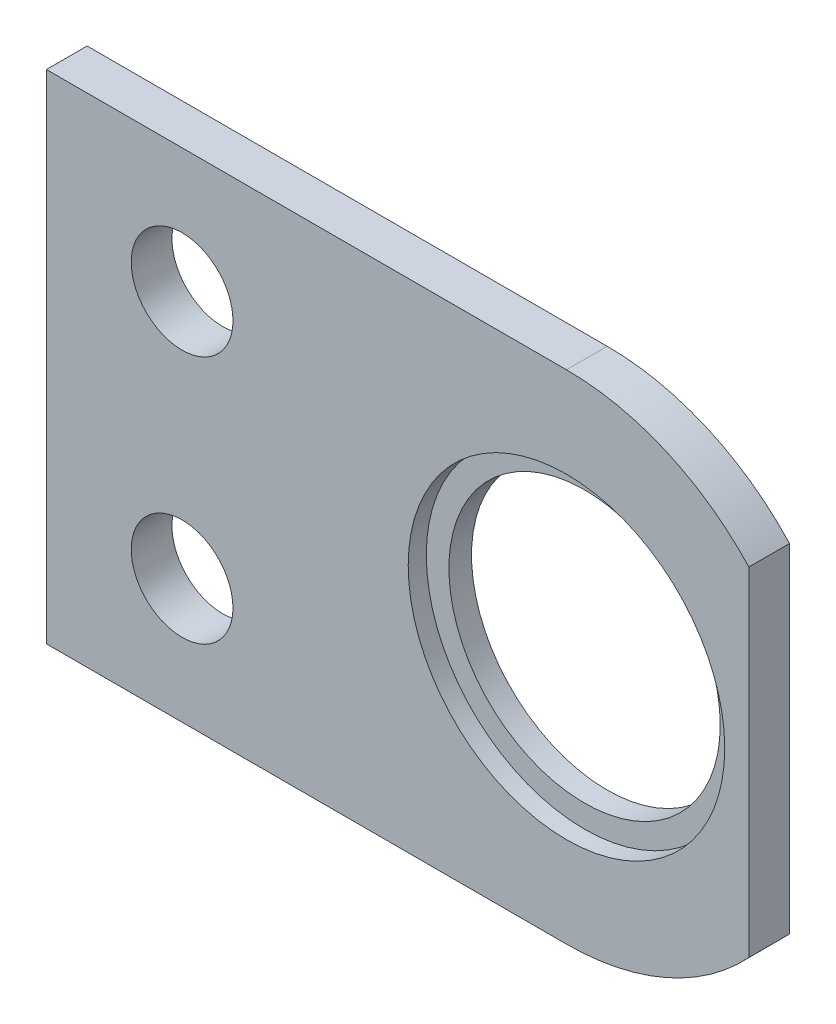
ISO-10303-21;
HEADER;
FILE_DESCRIPTION(('STEP AP214'),'2;1');
FILE_NAME('part.step','',(''),(''),'','','');
FILE_SCHEMA(('AUTOMOTIVE_DESIGN { 1 0 10303 214 1 1 1 1 }'));
ENDSEC;
DATA;
#1=APPLICATION_CONTEXT('core data for automotive mechanical design processes');
#2=APPLICATION_PROTOCOL_DEFINITION('international standard','automotive_design',2000,#1);
#3=PRODUCT_CONTEXT('',#1,'mechanical');
#4=PRODUCT('Part','Part','',(#3));
#5=PRODUCT_RELATED_PRODUCT_CATEGORY('part','',(#4));
#6=PRODUCT_DEFINITION_FORMATION('','',#4);
#7=PRODUCT_DEFINITION_CONTEXT('part definition',#1,'design');
#8=PRODUCT_DEFINITION('design','',#6,#7);
#9=PRODUCT_DEFINITION_SHAPE('','',#8);
#10=(LENGTH_UNIT() NAMED_UNIT(*) SI_UNIT(.MILLI.,.METRE.));
#11=(NAMED_UNIT(*) PLANE_ANGLE_UNIT() SI_UNIT($,.RADIAN.));
#12=(NAMED_UNIT(*) SI_UNIT($,.STERADIAN.) SOLID_ANGLE_UNIT());
#13=UNCERTAINTY_MEASURE_WITH_UNIT(LENGTH_MEASURE(1.E-05),#10,'distance_accuracy_value','');
#14=(GEOMETRIC_REPRESENTATION_CONTEXT(3) GLOBAL_UNCERTAINTY_ASSIGNED_CONTEXT((#13)) GLOBAL_UNIT_ASSIGNED_CONTEXT((#10,
#11,#12)) REPRESENTATION_CONTEXT('',''));
#15=CARTESIAN_POINT('',(0.,0.,0.));
#16=DIRECTION('',(0.,0.,1.));
#17=DIRECTION('',(1.,0.,0.));
#18=AXIS2_PLACEMENT_3D('',#15,#16,#17);
#19=CARTESIAN_POINT('',(-8.06644929286193,0.,1.8));
#20=DIRECTION('',(0.,0.,-1.));
#21=DIRECTION('',(-1.,0.,0.));
#22=AXIS2_PLACEMENT_3D('',#19,#20,#21);
#23=CYLINDRICAL_SURFACE('',#22,5.99999999999845);
#24=CARTESIAN_POINT('',(-8.06644929286193,0.,0.));
#25=DIRECTION('',(0.,0.,1.));
#26=DIRECTION('',(1.,0.,0.));
#27=AXIS2_PLACEMENT_3D('',#24,#25,#26);
#28=CIRCLE('',#27,5.99999999999845);
#29=CARTESIAN_POINT('',(-2.06644929286348,0.,0.));
#30=VERTEX_POINT('',#29);
#31=EDGE_CURVE('E255',#30,#30,#28,.T.);
#32=ORIENTED_EDGE('',*,*,#31,.F.);
#33=EDGE_LOOP('',(#32));
#34=FACE_BOUND('',#33,.T.);
#35=CARTESIAN_POINT('',(-8.06644929286193,0.,1.));
#36=DIRECTION('',(0.,0.,1.));
#37=DIRECTION('',(1.,0.,0.));
#38=AXIS2_PLACEMENT_3D('',#35,#36,#37);
#39=CIRCLE('',#38,5.99999999999845);
#40=CARTESIAN_POINT('',(-2.06644929286348,0.,1.));
#41=VERTEX_POINT('',#40);
#42=EDGE_CURVE('E39',#41,#41,#39,.T.);
#43=ORIENTED_EDGE('',*,*,#42,.T.);
#44=EDGE_LOOP('',(#43));
#45=FACE_BOUND('',#44,.T.);
#46=ADVANCED_FACE('F35',(#34,#45),#23,.F.);
#47=CARTESIAN_POINT('',(-8.06644929286193,0.,1.8));
#48=DIRECTION('',(0.,0.,1.));
#49=DIRECTION('',(1.,0.,0.));
#50=AXIS2_PLACEMENT_3D('',#47,#48,#49);
#51=PLANE('',#50);
#52=CARTESIAN_POINT('',(-8.06644929286193,0.,1.8));
#53=DIRECTION('',(0.,0.,1.));
#54=DIRECTION('',(1.,0.,0.));
#55=AXIS2_PLACEMENT_3D('',#52,#53,#54);
#56=CIRCLE('',#55,7.);
#57=CARTESIAN_POINT('',(-1.06644929286193,0.,1.8));
#58=VERTEX_POINT('',#57);
#59=EDGE_CURVE('E253',#58,#58,#56,.T.);
#60=ORIENTED_EDGE('',*,*,#59,.F.);
#61=EDGE_LOOP('',(#60));
#62=FACE_BOUND('',#61,.T.);
#63=CARTESIAN_POINT('',(-25.0664492928641,-5.50000000000008,1.8));
#64=DIRECTION('',(0.,0.,1.));
#65=DIRECTION('',(1.,0.,0.));
#66=AXIS2_PLACEMENT_3D('',#63,#64,#65);
#67=CIRCLE('',#66,2.25000000000009);
#68=CARTESIAN_POINT('',(-22.816449292864,-5.50000000000008,1.8));
#69=VERTEX_POINT('',#68);
#70=EDGE_CURVE('E262',#69,#69,#67,.T.);
#71=ORIENTED_EDGE('',*,*,#70,.F.);
#72=EDGE_LOOP('',(#71));
#73=FACE_BOUND('',#72,.T.);
#74=CARTESIAN_POINT('',(-8.06644929286193,0.,1.8));
#75=DIRECTION('',(0.,0.,1.));
#76=DIRECTION('',(1.,0.,0.));
#77=AXIS2_PLACEMENT_3D('',#74,#75,#76);
#78=CIRCLE('',#77,10.9999999999981);
#79=CARTESIAN_POINT('',(0.,7.47879641423996,1.8));
#80=VERTEX_POINT('',#79);
#81=CARTESIAN_POINT('',(-8.06644929286193,10.9999999999979,1.8));
#82=VERTEX_POINT('',#81);
#83=EDGE_CURVE('E133',#80,#82,#78,.T.);
#84=ORIENTED_EDGE('',*,*,#83,.T.);
#85=DIRECTION('',(-1.,0.,0.));
#86=VECTOR('',#85,1.);
#87=CARTESIAN_POINT('',(-8.06644929286193,10.9999999999979,1.8));
#88=LINE('',#87,#86);
#89=CARTESIAN_POINT('',(-31.0664492928643,10.9999999999979,1.8));
#90=VERTEX_POINT('',#89);
#91=EDGE_CURVE('E90',#82,#90,#88,.T.);
#92=ORIENTED_EDGE('',*,*,#91,.T.);
#93=DIRECTION('',(0.,-1.,0.));
#94=VECTOR('',#93,1.);
#95=CARTESIAN_POINT('',(-31.0664492928643,-10.9999999999984,1.8));
#96=LINE('',#95,#94);
#97=CARTESIAN_POINT('',(-31.0664492928643,-10.9999999999984,1.8));
#98=VERTEX_POINT('',#97);
#99=EDGE_CURVE('E104',#90,#98,#96,.T.);
#100=ORIENTED_EDGE('',*,*,#99,.T.);
#101=DIRECTION('',(1.,0.,0.));
#102=VECTOR('',#101,1.);
#103=CARTESIAN_POINT('',(-31.0664492928643,-10.9999999999984,1.8));
#104=LINE('',#103,#102);
#105=CARTESIAN_POINT('',(-8.06644929286193,-10.9999999999982,1.8));
#106=VERTEX_POINT('',#105);
#107=EDGE_CURVE('E97',#98,#106,#104,.T.);
#108=ORIENTED_EDGE('',*,*,#107,.T.);
#109=CARTESIAN_POINT('',(-8.06644929286193,0.,1.8));
#110=DIRECTION('',(0.,0.,1.));
#111=DIRECTION('',(1.,0.,0.));
#112=AXIS2_PLACEMENT_3D('',#109,#110,#111);
#113=CIRCLE('',#112,10.9999999999982);
#114=CARTESIAN_POINT('',(0.,-7.47879641423979,1.8));
#115=VERTEX_POINT('',#114);
#116=EDGE_CURVE('E102',#106,#115,#113,.T.);
#117=ORIENTED_EDGE('',*,*,#116,.T.);
#118=DIRECTION('',(0.,1.,0.));
#119=VECTOR('',#118,1.);
#120=CARTESIAN_POINT('',(0.,7.47879641423996,1.8));
#121=LINE('',#120,#119);
#122=EDGE_CURVE('E53',#115,#80,#121,.T.);
#123=ORIENTED_EDGE('',*,*,#122,.T.);
#124=EDGE_LOOP('',(#84,#92,#100,#108,#117,#123));
#125=FACE_BOUND('',#124,.T.);
#126=CARTESIAN_POINT('',(-25.0664492928641,5.49999999999982,1.8));
#127=DIRECTION('',(0.,0.,1.));
#128=DIRECTION('',(1.,0.,0.));
#129=AXIS2_PLACEMENT_3D('',#126,#127,#128);
#130=CIRCLE('',#129,2.25000000000009);
#131=CARTESIAN_POINT('',(-22.816449292864,5.49999999999982,1.8));
#132=VERTEX_POINT('',#131);
#133=EDGE_CURVE('E126',#132,#132,#130,.T.);
#134=ORIENTED_EDGE('',*,*,#133,.F.);
#135=EDGE_LOOP('',(#134));
#136=FACE_BOUND('',#135,.T.);
#137=ADVANCED_FACE('F99',(#62,#73,#125,#136),#51,.T.);
#138=CARTESIAN_POINT('',(-8.06644929286193,0.,0.));
#139=DIRECTION('',(0.,0.,1.));
#140=DIRECTION('',(1.,0.,0.));
#141=AXIS2_PLACEMENT_3D('',#138,#139,#140);
#142=PLANE('',#141);
#143=CARTESIAN_POINT('',(-8.06644929286193,0.,0.));
#144=DIRECTION('',(0.,0.,1.));
#145=DIRECTION('',(1.,0.,0.));
#146=AXIS2_PLACEMENT_3D('',#143,#144,#145);
#147=CIRCLE('',#146,10.9999999999981);
#148=CARTESIAN_POINT('',(0.,7.47879641423996,0.));
#149=VERTEX_POINT('',#148);
#150=CARTESIAN_POINT('',(-8.06644929286193,10.9999999999979,0.));
#151=VERTEX_POINT('',#150);
#152=EDGE_CURVE('E122',#149,#151,#147,.T.);
#153=ORIENTED_EDGE('',*,*,#152,.F.);
#154=DIRECTION('',(0.,1.,0.));
#155=VECTOR('',#154,1.);
#156=CARTESIAN_POINT('',(0.,7.47879641423996,0.));
#157=LINE('',#156,#155);
#158=CARTESIAN_POINT('',(0.,-7.47879641423979,0.));
#159=VERTEX_POINT('',#158);
#160=EDGE_CURVE('E82',#159,#149,#157,.T.);
#161=ORIENTED_EDGE('',*,*,#160,.F.);
#162=CARTESIAN_POINT('',(-8.06644929286193,0.,0.));
#163=DIRECTION('',(0.,0.,1.));
#164=DIRECTION('',(1.,0.,0.));
#165=AXIS2_PLACEMENT_3D('',#162,#163,#164);
#166=CIRCLE('',#165,10.9999999999982);
#167=CARTESIAN_POINT('',(-8.06644929286193,-10.9999999999982,0.));
#168=VERTEX_POINT('',#167);
#169=EDGE_CURVE('E76',#168,#159,#166,.T.);
#170=ORIENTED_EDGE('',*,*,#169,.F.);
#171=DIRECTION('',(1.,0.,0.));
#172=VECTOR('',#171,1.);
#173=CARTESIAN_POINT('',(-31.0664492928643,-10.9999999999984,0.));
#174=LINE('',#173,#172);
#175=CARTESIAN_POINT('',(-31.0664492928643,-10.9999999999984,0.));
#176=VERTEX_POINT('',#175);
#177=EDGE_CURVE('E112',#176,#168,#174,.T.);
#178=ORIENTED_EDGE('',*,*,#177,.F.);
#179=DIRECTION('',(0.,-1.,0.));
#180=VECTOR('',#179,1.);
#181=CARTESIAN_POINT('',(-31.0664492928643,-10.9999999999984,0.));
#182=LINE('',#181,#180);
#183=CARTESIAN_POINT('',(-31.0664492928643,10.9999999999979,0.));
#184=VERTEX_POINT('',#183);
#185=EDGE_CURVE('E128',#184,#176,#182,.T.);
#186=ORIENTED_EDGE('',*,*,#185,.F.);
#187=DIRECTION('',(-1.,0.,0.));
#188=VECTOR('',#187,1.);
#189=CARTESIAN_POINT('',(-8.06644929286193,10.9999999999979,0.));
#190=LINE('',#189,#188);
#191=EDGE_CURVE('E125',#151,#184,#190,.T.);
#192=ORIENTED_EDGE('',*,*,#191,.F.);
#193=EDGE_LOOP('',(#153,#161,#170,#178,#186,#192));
#194=FACE_BOUND('',#193,.T.);
#195=CARTESIAN_POINT('',(-25.0664492928641,5.49999999999982,0.));
#196=DIRECTION('',(0.,0.,1.));
#197=DIRECTION('',(1.,0.,0.));
#198=AXIS2_PLACEMENT_3D('',#195,#196,#197);
#199=CIRCLE('',#198,2.25000000000009);
#200=CARTESIAN_POINT('',(-22.816449292864,5.49999999999982,0.));
#201=VERTEX_POINT('',#200);
#202=EDGE_CURVE('E265',#201,#201,#199,.T.);
#203=ORIENTED_EDGE('',*,*,#202,.T.);
#204=EDGE_LOOP('',(#203));
#205=FACE_BOUND('',#204,.T.);
#206=CARTESIAN_POINT('',(-25.0664492928641,-5.50000000000008,0.));
#207=DIRECTION('',(0.,0.,1.));
#208=DIRECTION('',(1.,0.,0.));
#209=AXIS2_PLACEMENT_3D('',#206,#207,#208);
#210=CIRCLE('',#209,2.25000000000009);
#211=CARTESIAN_POINT('',(-22.816449292864,-5.50000000000008,0.));
#212=VERTEX_POINT('',#211);
#213=EDGE_CURVE('E261',#212,#212,#210,.T.);
#214=ORIENTED_EDGE('',*,*,#213,.T.);
#215=EDGE_LOOP('',(#214));
#216=FACE_BOUND('',#215,.T.);
#217=ORIENTED_EDGE('',*,*,#31,.T.);
#218=EDGE_LOOP('',(#217));
#219=FACE_BOUND('',#218,.T.);
#220=ADVANCED_FACE('F143',(#194,#205,#216,#219),#142,.F.);
#221=CARTESIAN_POINT('',(-8.06644929286193,0.,1.8));
#222=DIRECTION('',(0.,0.,-1.));
#223=DIRECTION('',(-1.,0.,0.));
#224=AXIS2_PLACEMENT_3D('',#221,#222,#223);
#225=CYLINDRICAL_SURFACE('',#224,10.9999999999981);
#226=ORIENTED_EDGE('',*,*,#152,.T.);
#227=DIRECTION('',(0.,0.,-1.));
#228=VECTOR('',#227,1.);
#229=CARTESIAN_POINT('',(-8.06644929286193,10.9999999999979,1.8));
#230=LINE('',#229,#228);
#231=EDGE_CURVE('E11',#82,#151,#230,.T.);
#232=ORIENTED_EDGE('',*,*,#231,.F.);
#233=ORIENTED_EDGE('',*,*,#83,.F.);
#234=DIRECTION('',(0.,0.,-1.));
#235=VECTOR('',#234,1.);
#236=CARTESIAN_POINT('',(0.,7.47879641423996,1.8));
#237=LINE('',#236,#235);
#238=EDGE_CURVE('E118',#80,#149,#237,.T.);
#239=ORIENTED_EDGE('',*,*,#238,.T.);
#240=EDGE_LOOP('',(#226,#232,#233,#239));
#241=FACE_BOUND('',#240,.T.);
#242=ADVANCED_FACE('F37',(#241),#225,.T.);
#243=CARTESIAN_POINT('',(-8.06644929286193,10.9999999999979,1.8));
#244=DIRECTION('',(0.,-1.,0.));
#245=DIRECTION('',(0.,0.,-1.));
#246=AXIS2_PLACEMENT_3D('',#243,#244,#245);
#247=PLANE('',#246);
#248=ORIENTED_EDGE('',*,*,#191,.T.);
#249=DIRECTION('',(0.,0.,-1.));
#250=VECTOR('',#249,1.);
#251=CARTESIAN_POINT('',(-31.0664492928643,10.9999999999979,1.8));
#252=LINE('',#251,#250);
#253=EDGE_CURVE('E45',#90,#184,#252,.T.);
#254=ORIENTED_EDGE('',*,*,#253,.F.);
#255=ORIENTED_EDGE('',*,*,#91,.F.);
#256=ORIENTED_EDGE('',*,*,#231,.T.);
#257=EDGE_LOOP('',(#248,#254,#255,#256));
#258=FACE_BOUND('',#257,.T.);
#259=ADVANCED_FACE('F181',(#258),#247,.F.);
#260=CARTESIAN_POINT('',(-31.0664492928643,-10.9999999999984,1.8));
#261=DIRECTION('',(1.,0.,0.));
#262=DIRECTION('',(0.,0.,-1.));
#263=AXIS2_PLACEMENT_3D('',#260,#261,#262);
#264=PLANE('',#263);
#265=ORIENTED_EDGE('',*,*,#185,.T.);
#266=DIRECTION('',(0.,0.,-1.));
#267=VECTOR('',#266,1.);
#268=CARTESIAN_POINT('',(-31.0664492928643,-10.9999999999984,1.8));
#269=LINE('',#268,#267);
#270=EDGE_CURVE('E113',#98,#176,#269,.T.);
#271=ORIENTED_EDGE('',*,*,#270,.F.);
#272=ORIENTED_EDGE('',*,*,#99,.F.);
#273=ORIENTED_EDGE('',*,*,#253,.T.);
#274=EDGE_LOOP('',(#265,#271,#272,#273));
#275=FACE_BOUND('',#274,.T.);
#276=ADVANCED_FACE('F140',(#275),#264,.F.);
#277=CARTESIAN_POINT('',(-31.0664492928643,-10.9999999999984,1.8));
#278=DIRECTION('',(0.,1.,0.));
#279=DIRECTION('',(0.,0.,1.));
#280=AXIS2_PLACEMENT_3D('',#277,#278,#279);
#281=PLANE('',#280);
#282=ORIENTED_EDGE('',*,*,#177,.T.);
#283=DIRECTION('',(0.,0.,-1.));
#284=VECTOR('',#283,1.);
#285=CARTESIAN_POINT('',(-8.06644929286193,-10.9999999999982,1.8));
#286=LINE('',#285,#284);
#287=EDGE_CURVE('E109',#106,#168,#286,.T.);
#288=ORIENTED_EDGE('',*,*,#287,.F.);
#289=ORIENTED_EDGE('',*,*,#107,.F.);
#290=ORIENTED_EDGE('',*,*,#270,.T.);
#291=EDGE_LOOP('',(#282,#288,#289,#290));
#292=FACE_BOUND('',#291,.T.);
#293=ADVANCED_FACE('F110',(#292),#281,.F.);
#294=CARTESIAN_POINT('',(-8.06644929286193,0.,1.8));
#295=DIRECTION('',(0.,0.,-1.));
#296=DIRECTION('',(-1.,0.,0.));
#297=AXIS2_PLACEMENT_3D('',#294,#295,#296);
#298=CYLINDRICAL_SURFACE('',#297,10.9999999999982);
#299=ORIENTED_EDGE('',*,*,#169,.T.);
#300=DIRECTION('',(0.,0.,-1.));
#301=VECTOR('',#300,1.);
#302=CARTESIAN_POINT('',(0.,-7.47879641423979,1.8));
#303=LINE('',#302,#301);
#304=EDGE_CURVE('E114',#115,#159,#303,.T.);
#305=ORIENTED_EDGE('',*,*,#304,.F.);
#306=ORIENTED_EDGE('',*,*,#116,.F.);
#307=ORIENTED_EDGE('',*,*,#287,.T.);
#308=EDGE_LOOP('',(#299,#305,#306,#307));
#309=FACE_BOUND('',#308,.T.);
#310=ADVANCED_FACE('F116',(#309),#298,.T.);
#311=CARTESIAN_POINT('',(0.,7.47879641423996,1.8));
#312=DIRECTION('',(-1.,0.,0.));
#313=DIRECTION('',(0.,0.,1.));
#314=AXIS2_PLACEMENT_3D('',#311,#312,#313);
#315=PLANE('',#314);
#316=ORIENTED_EDGE('',*,*,#160,.T.);
#317=ORIENTED_EDGE('',*,*,#238,.F.);
#318=ORIENTED_EDGE('',*,*,#122,.F.);
#319=ORIENTED_EDGE('',*,*,#304,.T.);
#320=EDGE_LOOP('',(#316,#317,#318,#319));
#321=FACE_BOUND('',#320,.T.);
#322=ADVANCED_FACE('F148',(#321),#315,.F.);
#323=CARTESIAN_POINT('',(-25.0664492928641,5.49999999999982,1.8));
#324=DIRECTION('',(0.,0.,-1.));
#325=DIRECTION('',(-1.,0.,0.));
#326=AXIS2_PLACEMENT_3D('',#323,#324,#325);
#327=CYLINDRICAL_SURFACE('',#326,2.25000000000009);
#328=ORIENTED_EDGE('',*,*,#133,.T.);
#329=EDGE_LOOP('',(#328));
#330=FACE_BOUND('',#329,.T.);
#331=ORIENTED_EDGE('',*,*,#202,.F.);
#332=EDGE_LOOP('',(#331));
#333=FACE_BOUND('',#332,.T.);
#334=ADVANCED_FACE('F150',(#330,#333),#327,.F.);
#335=CARTESIAN_POINT('',(-25.0664492928641,-5.50000000000008,1.8));
#336=DIRECTION('',(0.,0.,-1.));
#337=DIRECTION('',(-1.,0.,0.));
#338=AXIS2_PLACEMENT_3D('',#335,#336,#337);
#339=CYLINDRICAL_SURFACE('',#338,2.25000000000009);
#340=ORIENTED_EDGE('',*,*,#70,.T.);
#341=EDGE_LOOP('',(#340));
#342=FACE_BOUND('',#341,.T.);
#343=ORIENTED_EDGE('',*,*,#213,.F.);
#344=EDGE_LOOP('',(#343));
#345=FACE_BOUND('',#344,.T.);
#346=ADVANCED_FACE('F156',(#342,#345),#339,.F.);
#347=CARTESIAN_POINT('',(-8.06644929286193,0.,1.));
#348=DIRECTION('',(0.,0.,1.));
#349=DIRECTION('',(1.,0.,0.));
#350=AXIS2_PLACEMENT_3D('',#347,#348,#349);
#351=CYLINDRICAL_SURFACE('',#350,7.);
#352=CARTESIAN_POINT('',(-8.06644929286193,0.,1.));
#353=DIRECTION('',(0.,0.,1.));
#354=DIRECTION('',(1.,0.,0.));
#355=AXIS2_PLACEMENT_3D('',#352,#353,#354);
#356=CIRCLE('',#355,7.);
#357=CARTESIAN_POINT('',(-1.06644929286193,0.,1.));
#358=VERTEX_POINT('',#357);
#359=EDGE_CURVE('E252',#358,#358,#356,.T.);
#360=ORIENTED_EDGE('',*,*,#359,.F.);
#361=EDGE_LOOP('',(#360));
#362=FACE_BOUND('',#361,.T.);
#363=ORIENTED_EDGE('',*,*,#59,.T.);
#364=EDGE_LOOP('',(#363));
#365=FACE_BOUND('',#364,.T.);
#366=ADVANCED_FACE('F173',(#362,#365),#351,.F.);
#367=CARTESIAN_POINT('',(-8.06644929286193,0.,1.));
#368=DIRECTION('',(0.,0.,1.));
#369=DIRECTION('',(1.,0.,0.));
#370=AXIS2_PLACEMENT_3D('',#367,#368,#369);
#371=PLANE('',#370);
#372=ORIENTED_EDGE('',*,*,#42,.F.);
#373=EDGE_LOOP('',(#372));
#374=FACE_BOUND('',#373,.T.);
#375=ORIENTED_EDGE('',*,*,#359,.T.);
#376=EDGE_LOOP('',(#375));
#377=FACE_BOUND('',#376,.T.);
#378=ADVANCED_FACE('F235',(#374,#377),#371,.T.);
#379=CLOSED_SHELL('',(#46,#137,#220,#242,#259,#276,#293,#310,#322,#334,#346,#366,#378));
#380=MANIFOLD_SOLID_BREP('B2',#379);
#381=ADVANCED_BREP_SHAPE_REPRESENTATION('',(#18,#380),#14);
#382=SHAPE_DEFINITION_REPRESENTATION(#9,#381);
ENDSEC;
END-ISO-10303-21;
